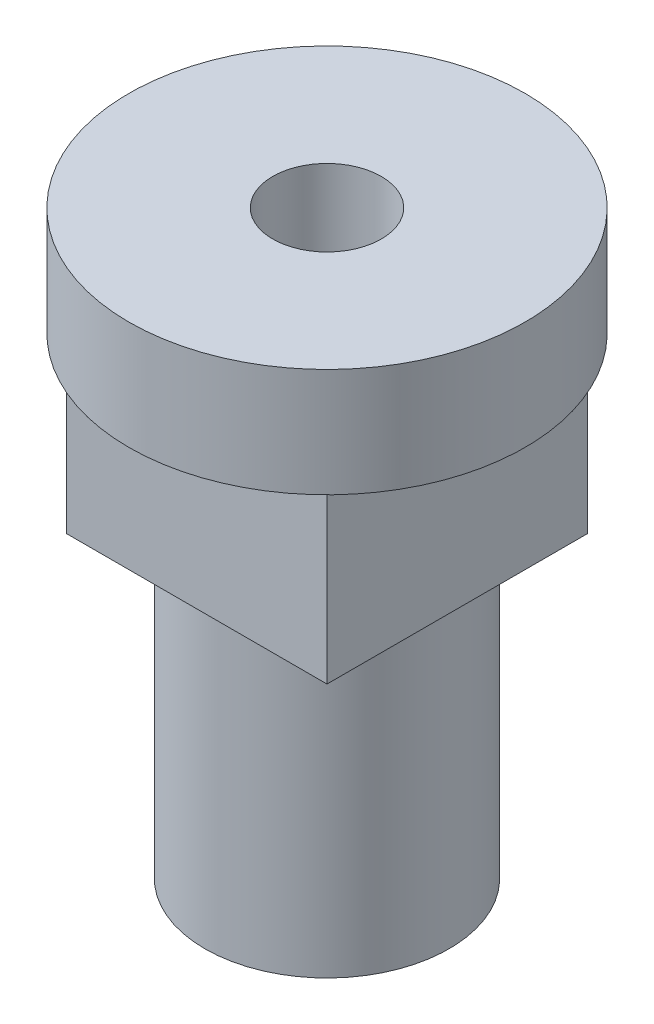
ISO-10303-21;
HEADER;
FILE_DESCRIPTION(('STEP AP214'),'2;1');
FILE_NAME('part.step','',(''),(''),'','','');
FILE_SCHEMA(('AUTOMOTIVE_DESIGN { 1 0 10303 214 1 1 1 1 }'));
ENDSEC;
DATA;
#1=APPLICATION_CONTEXT('core data for automotive mechanical design processes');
#2=APPLICATION_PROTOCOL_DEFINITION('international standard','automotive_design',2000,#1);
#3=PRODUCT_CONTEXT('',#1,'mechanical');
#4=PRODUCT('Part','Part','',(#3));
#5=PRODUCT_RELATED_PRODUCT_CATEGORY('part','',(#4));
#6=PRODUCT_DEFINITION_FORMATION('','',#4);
#7=PRODUCT_DEFINITION_CONTEXT('part definition',#1,'design');
#8=PRODUCT_DEFINITION('design','',#6,#7);
#9=PRODUCT_DEFINITION_SHAPE('','',#8);
#10=(LENGTH_UNIT() NAMED_UNIT(*) SI_UNIT(.MILLI.,.METRE.));
#11=(NAMED_UNIT(*) PLANE_ANGLE_UNIT() SI_UNIT($,.RADIAN.));
#12=(NAMED_UNIT(*) SI_UNIT($,.STERADIAN.) SOLID_ANGLE_UNIT());
#13=UNCERTAINTY_MEASURE_WITH_UNIT(LENGTH_MEASURE(1.E-05),#10,'distance_accuracy_value','');
#14=(GEOMETRIC_REPRESENTATION_CONTEXT(3) GLOBAL_UNCERTAINTY_ASSIGNED_CONTEXT((#13)) GLOBAL_UNIT_ASSIGNED_CONTEXT((#10,
#11,#12)) REPRESENTATION_CONTEXT('',''));
#15=CARTESIAN_POINT('',(0.,0.,0.));
#16=DIRECTION('',(0.,0.,1.));
#17=DIRECTION('',(1.,0.,0.));
#18=AXIS2_PLACEMENT_3D('',#15,#16,#17);
#19=CARTESIAN_POINT('',(0.,11.,0.));
#20=DIRECTION('',(0.,-1.,0.));
#21=DIRECTION('',(0.,0.,-1.));
#22=AXIS2_PLACEMENT_3D('',#19,#20,#21);
#23=CYLINDRICAL_SURFACE('',#22,4.5);
#24=CARTESIAN_POINT('',(0.,11.,0.));
#25=DIRECTION('',(0.,1.,0.));
#26=DIRECTION('',(0.,0.,1.));
#27=AXIS2_PLACEMENT_3D('',#24,#25,#26);
#28=CIRCLE('',#27,4.5);
#29=CARTESIAN_POINT('',(0.,11.,4.5));
#30=VERTEX_POINT('',#29);
#31=EDGE_CURVE('E11',#30,#30,#28,.T.);
#32=ORIENTED_EDGE('',*,*,#31,.F.);
#33=EDGE_LOOP('',(#32));
#34=FACE_BOUND('',#33,.T.);
#35=CARTESIAN_POINT('',(0.,0.,0.));
#36=DIRECTION('',(0.,1.,0.));
#37=DIRECTION('',(0.,0.,1.));
#38=AXIS2_PLACEMENT_3D('',#35,#36,#37);
#39=CIRCLE('',#38,4.5);
#40=CARTESIAN_POINT('',(0.,0.,4.5));
#41=VERTEX_POINT('',#40);
#42=EDGE_CURVE('E42',#41,#41,#39,.T.);
#43=ORIENTED_EDGE('',*,*,#42,.T.);
#44=EDGE_LOOP('',(#43));
#45=FACE_BOUND('',#44,.T.);
#46=ADVANCED_FACE('F39',(#34,#45),#23,.T.);
#47=CARTESIAN_POINT('',(0.,0.,0.));
#48=DIRECTION('',(0.,1.,0.));
#49=DIRECTION('',(0.,0.,1.));
#50=AXIS2_PLACEMENT_3D('',#47,#48,#49);
#51=PLANE('',#50);
#52=ORIENTED_EDGE('',*,*,#42,.F.);
#53=EDGE_LOOP('',(#52));
#54=FACE_BOUND('',#53,.T.);
#55=ADVANCED_FACE('F122',(#54),#51,.F.);
#56=CARTESIAN_POINT('',(-4.8,17.4,0.));
#57=DIRECTION('',(1.,0.,0.));
#58=DIRECTION('',(0.,0.,-1.));
#59=AXIS2_PLACEMENT_3D('',#56,#57,#58);
#60=PLANE('',#59);
#61=DIRECTION('',(0.,0.,1.));
#62=VECTOR('',#61,1.);
#63=CARTESIAN_POINT('',(-4.8,11.,0.));
#64=LINE('',#63,#62);
#65=CARTESIAN_POINT('',(-4.8,11.,-4.8));
#66=VERTEX_POINT('',#65);
#67=CARTESIAN_POINT('',(-4.8,11.,4.8));
#68=VERTEX_POINT('',#67);
#69=EDGE_CURVE('E103',#66,#68,#64,.T.);
#70=ORIENTED_EDGE('',*,*,#69,.T.);
#71=DIRECTION('',(0.,-1.,0.));
#72=VECTOR('',#71,1.);
#73=CARTESIAN_POINT('',(-4.8,17.4,4.8));
#74=LINE('',#73,#72);
#75=CARTESIAN_POINT('',(-4.8,17.4,4.8));
#76=VERTEX_POINT('',#75);
#77=EDGE_CURVE('E79',#76,#68,#74,.T.);
#78=ORIENTED_EDGE('',*,*,#77,.F.);
#79=DIRECTION('',(0.,0.,1.));
#80=VECTOR('',#79,1.);
#81=CARTESIAN_POINT('',(-4.8,17.4,0.));
#82=LINE('',#81,#80);
#83=CARTESIAN_POINT('',(-4.8,17.4,-4.8));
#84=VERTEX_POINT('',#83);
#85=EDGE_CURVE('E83',#84,#76,#82,.T.);
#86=ORIENTED_EDGE('',*,*,#85,.F.);
#87=DIRECTION('',(0.,-1.,0.));
#88=VECTOR('',#87,1.);
#89=CARTESIAN_POINT('',(-4.8,17.4,-4.8));
#90=LINE('',#89,#88);
#91=EDGE_CURVE('E85',#84,#66,#90,.T.);
#92=ORIENTED_EDGE('',*,*,#91,.T.);
#93=EDGE_LOOP('',(#70,#78,#86,#92));
#94=FACE_BOUND('',#93,.T.);
#95=ADVANCED_FACE('F84',(#94),#60,.F.);
#96=CARTESIAN_POINT('',(0.,17.4,4.8));
#97=DIRECTION('',(0.,0.,1.));
#98=DIRECTION('',(1.,0.,0.));
#99=AXIS2_PLACEMENT_3D('',#96,#97,#98);
#100=PLANE('',#99);
#101=DIRECTION('',(-1.,0.,0.));
#102=VECTOR('',#101,1.);
#103=CARTESIAN_POINT('',(0.,11.,4.8));
#104=LINE('',#103,#102);
#105=CARTESIAN_POINT('',(4.8,11.,4.8));
#106=VERTEX_POINT('',#105);
#107=EDGE_CURVE('E105',#106,#68,#104,.T.);
#108=ORIENTED_EDGE('',*,*,#107,.F.);
#109=DIRECTION('',(0.,-1.,0.));
#110=VECTOR('',#109,1.);
#111=CARTESIAN_POINT('',(4.8,17.4,4.8));
#112=LINE('',#111,#110);
#113=CARTESIAN_POINT('',(4.8,17.4,4.8));
#114=VERTEX_POINT('',#113);
#115=EDGE_CURVE('E114',#114,#106,#112,.T.);
#116=ORIENTED_EDGE('',*,*,#115,.F.);
#117=DIRECTION('',(-1.,0.,0.));
#118=VECTOR('',#117,1.);
#119=CARTESIAN_POINT('',(0.,17.4,4.8));
#120=LINE('',#119,#118);
#121=EDGE_CURVE('E90',#114,#76,#120,.T.);
#122=ORIENTED_EDGE('',*,*,#121,.T.);
#123=ORIENTED_EDGE('',*,*,#77,.T.);
#124=EDGE_LOOP('',(#108,#116,#122,#123));
#125=FACE_BOUND('',#124,.T.);
#126=ADVANCED_FACE('F129',(#125),#100,.T.);
#127=CARTESIAN_POINT('',(4.8,17.4,0.));
#128=DIRECTION('',(1.,0.,0.));
#129=DIRECTION('',(0.,0.,-1.));
#130=AXIS2_PLACEMENT_3D('',#127,#128,#129);
#131=PLANE('',#130);
#132=DIRECTION('',(0.,0.,1.));
#133=VECTOR('',#132,1.);
#134=CARTESIAN_POINT('',(4.8,11.,0.));
#135=LINE('',#134,#133);
#136=CARTESIAN_POINT('',(4.8,11.,-4.8));
#137=VERTEX_POINT('',#136);
#138=EDGE_CURVE('E109',#137,#106,#135,.T.);
#139=ORIENTED_EDGE('',*,*,#138,.F.);
#140=DIRECTION('',(0.,-1.,0.));
#141=VECTOR('',#140,1.);
#142=CARTESIAN_POINT('',(4.8,17.4,-4.8));
#143=LINE('',#142,#141);
#144=CARTESIAN_POINT('',(4.8,17.4,-4.8));
#145=VERTEX_POINT('',#144);
#146=EDGE_CURVE('E55',#145,#137,#143,.T.);
#147=ORIENTED_EDGE('',*,*,#146,.F.);
#148=DIRECTION('',(0.,0.,1.));
#149=VECTOR('',#148,1.);
#150=CARTESIAN_POINT('',(4.8,17.4,0.));
#151=LINE('',#150,#149);
#152=EDGE_CURVE('E98',#145,#114,#151,.T.);
#153=ORIENTED_EDGE('',*,*,#152,.T.);
#154=ORIENTED_EDGE('',*,*,#115,.T.);
#155=EDGE_LOOP('',(#139,#147,#153,#154));
#156=FACE_BOUND('',#155,.T.);
#157=ADVANCED_FACE('F135',(#156),#131,.T.);
#158=CARTESIAN_POINT('',(0.,17.4,-4.8));
#159=DIRECTION('',(0.,0.,1.));
#160=DIRECTION('',(1.,0.,0.));
#161=AXIS2_PLACEMENT_3D('',#158,#159,#160);
#162=PLANE('',#161);
#163=DIRECTION('',(-1.,0.,0.));
#164=VECTOR('',#163,1.);
#165=CARTESIAN_POINT('',(0.,11.,-4.8));
#166=LINE('',#165,#164);
#167=EDGE_CURVE('E73',#137,#66,#166,.T.);
#168=ORIENTED_EDGE('',*,*,#167,.T.);
#169=ORIENTED_EDGE('',*,*,#91,.F.);
#170=DIRECTION('',(-1.,0.,0.));
#171=VECTOR('',#170,1.);
#172=CARTESIAN_POINT('',(0.,17.4,-4.8));
#173=LINE('',#172,#171);
#174=EDGE_CURVE('E93',#145,#84,#173,.T.);
#175=ORIENTED_EDGE('',*,*,#174,.F.);
#176=ORIENTED_EDGE('',*,*,#146,.T.);
#177=EDGE_LOOP('',(#168,#169,#175,#176));
#178=FACE_BOUND('',#177,.T.);
#179=ADVANCED_FACE('F92',(#178),#162,.F.);
#180=CARTESIAN_POINT('',(0.,11.,0.));
#181=DIRECTION('',(0.,-1.,0.));
#182=DIRECTION('',(0.,0.,-1.));
#183=AXIS2_PLACEMENT_3D('',#180,#181,#182);
#184=PLANE('',#183);
#185=ORIENTED_EDGE('',*,*,#31,.T.);
#186=EDGE_LOOP('',(#185));
#187=FACE_BOUND('',#186,.T.);
#188=ORIENTED_EDGE('',*,*,#69,.F.);
#189=ORIENTED_EDGE('',*,*,#167,.F.);
#190=ORIENTED_EDGE('',*,*,#138,.T.);
#191=ORIENTED_EDGE('',*,*,#107,.T.);
#192=EDGE_LOOP('',(#188,#189,#190,#191));
#193=FACE_BOUND('',#192,.T.);
#194=ADVANCED_FACE('F140',(#187,#193),#184,.T.);
#195=CARTESIAN_POINT('',(0.,21.4,0.));
#196=DIRECTION('',(0.,-1.,0.));
#197=DIRECTION('',(0.,0.,-1.));
#198=AXIS2_PLACEMENT_3D('',#195,#196,#197);
#199=CYLINDRICAL_SURFACE('',#198,7.3);
#200=CARTESIAN_POINT('',(0.,21.4,0.));
#201=DIRECTION('',(0.,-1.,0.));
#202=DIRECTION('',(0.,0.,-1.));
#203=AXIS2_PLACEMENT_3D('',#200,#201,#202);
#204=CIRCLE('',#203,7.3);
#205=CARTESIAN_POINT('',(0.,21.4,-7.3));
#206=VERTEX_POINT('',#205);
#207=EDGE_CURVE('E106',#206,#206,#204,.T.);
#208=ORIENTED_EDGE('',*,*,#207,.T.);
#209=EDGE_LOOP('',(#208));
#210=FACE_BOUND('',#209,.T.);
#211=CARTESIAN_POINT('',(0.,17.4,0.));
#212=DIRECTION('',(0.,-1.,0.));
#213=DIRECTION('',(0.,0.,-1.));
#214=AXIS2_PLACEMENT_3D('',#211,#212,#213);
#215=CIRCLE('',#214,7.3);
#216=CARTESIAN_POINT('',(0.,17.4,-7.3));
#217=VERTEX_POINT('',#216);
#218=EDGE_CURVE('E165',#217,#217,#215,.T.);
#219=ORIENTED_EDGE('',*,*,#218,.F.);
#220=EDGE_LOOP('',(#219));
#221=FACE_BOUND('',#220,.T.);
#222=ADVANCED_FACE('F142',(#210,#221),#199,.T.);
#223=CARTESIAN_POINT('',(0.,21.4,0.));
#224=DIRECTION('',(0.,-1.,0.));
#225=DIRECTION('',(0.,0.,-1.));
#226=AXIS2_PLACEMENT_3D('',#223,#224,#225);
#227=PLANE('',#226);
#228=CARTESIAN_POINT('',(0.,21.4,0.));
#229=DIRECTION('',(0.,-1.,0.));
#230=DIRECTION('',(0.,0.,-1.));
#231=AXIS2_PLACEMENT_3D('',#228,#229,#230);
#232=CIRCLE('',#231,2.);
#233=CARTESIAN_POINT('',(0.,21.4,-2.));
#234=VERTEX_POINT('',#233);
#235=EDGE_CURVE('E166',#234,#234,#232,.T.);
#236=ORIENTED_EDGE('',*,*,#235,.T.);
#237=EDGE_LOOP('',(#236));
#238=FACE_BOUND('',#237,.T.);
#239=ORIENTED_EDGE('',*,*,#207,.F.);
#240=EDGE_LOOP('',(#239));
#241=FACE_BOUND('',#240,.T.);
#242=ADVANCED_FACE('F146',(#238,#241),#227,.F.);
#243=CARTESIAN_POINT('',(0.,17.4,0.));
#244=DIRECTION('',(0.,-1.,0.));
#245=DIRECTION('',(0.,0.,-1.));
#246=AXIS2_PLACEMENT_3D('',#243,#244,#245);
#247=PLANE('',#246);
#248=ORIENTED_EDGE('',*,*,#174,.T.);
#249=ORIENTED_EDGE('',*,*,#85,.T.);
#250=ORIENTED_EDGE('',*,*,#121,.F.);
#251=ORIENTED_EDGE('',*,*,#152,.F.);
#252=EDGE_LOOP('',(#248,#249,#250,#251));
#253=FACE_BOUND('',#252,.T.);
#254=ORIENTED_EDGE('',*,*,#218,.T.);
#255=EDGE_LOOP('',(#254));
#256=FACE_BOUND('',#255,.T.);
#257=ADVANCED_FACE('F96',(#253,#256),#247,.T.);
#258=CARTESIAN_POINT('',(0.,11.4,0.));
#259=DIRECTION('',(0.,1.,0.));
#260=DIRECTION('',(0.,0.,1.));
#261=AXIS2_PLACEMENT_3D('',#258,#259,#260);
#262=CYLINDRICAL_SURFACE('',#261,2.);
#263=CARTESIAN_POINT('',(0.,11.4,0.));
#264=DIRECTION('',(0.,-1.,0.));
#265=DIRECTION('',(0.,0.,-1.));
#266=AXIS2_PLACEMENT_3D('',#263,#264,#265);
#267=CIRCLE('',#266,2.);
#268=CARTESIAN_POINT('',(0.,11.4,-2.));
#269=VERTEX_POINT('',#268);
#270=EDGE_CURVE('E164',#269,#269,#267,.T.);
#271=ORIENTED_EDGE('',*,*,#270,.T.);
#272=EDGE_LOOP('',(#271));
#273=FACE_BOUND('',#272,.T.);
#274=ORIENTED_EDGE('',*,*,#235,.F.);
#275=EDGE_LOOP('',(#274));
#276=FACE_BOUND('',#275,.T.);
#277=ADVANCED_FACE('F150',(#273,#276),#262,.F.);
#278=CARTESIAN_POINT('',(0.,11.4,0.));
#279=DIRECTION('',(0.,-1.,0.));
#280=DIRECTION('',(0.,0.,-1.));
#281=AXIS2_PLACEMENT_3D('',#278,#279,#280);
#282=PLANE('',#281);
#283=ORIENTED_EDGE('',*,*,#270,.F.);
#284=EDGE_LOOP('',(#283));
#285=FACE_BOUND('',#284,.T.);
#286=ADVANCED_FACE('F156',(#285),#282,.F.);
#287=CLOSED_SHELL('',(#46,#55,#95,#126,#157,#179,#194,#222,#242,#257,#277,#286));
#288=MANIFOLD_SOLID_BREP('B2',#287);
#289=ADVANCED_BREP_SHAPE_REPRESENTATION('',(#18,#288),#14);
#290=SHAPE_DEFINITION_REPRESENTATION(#9,#289);
ENDSEC;
END-ISO-10303-21;
